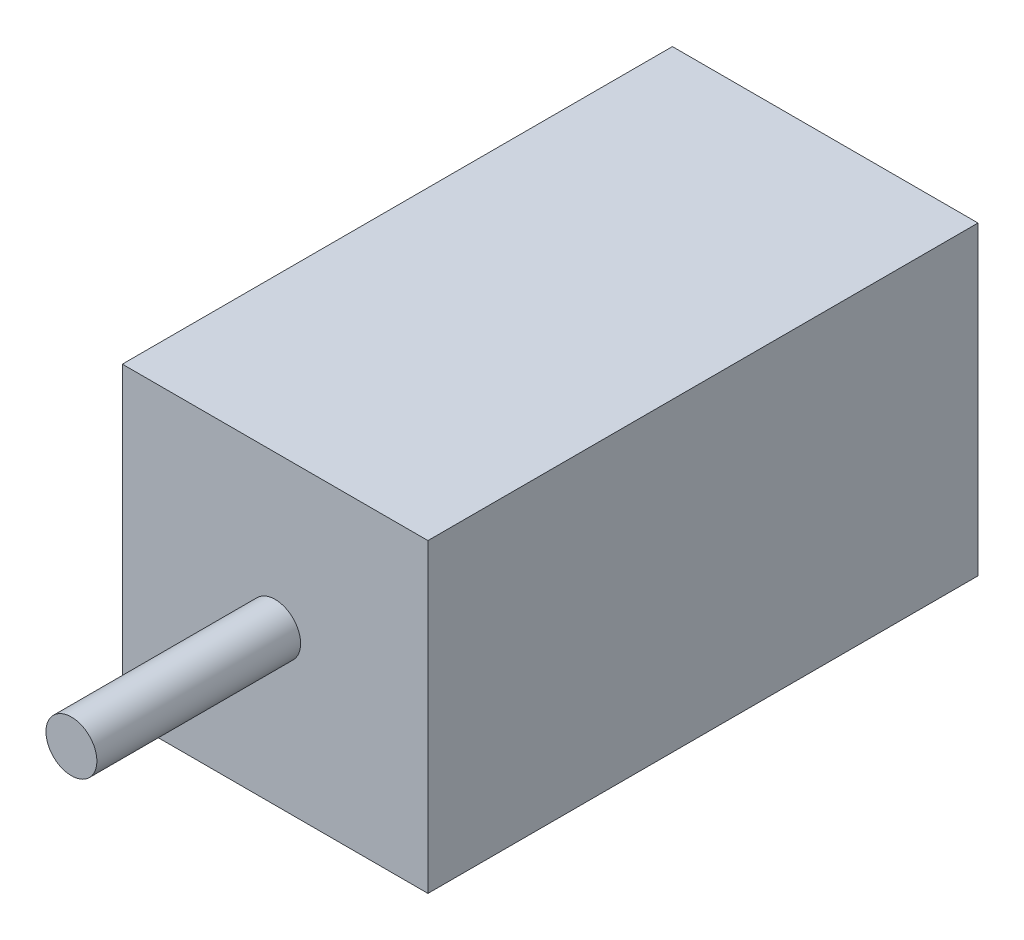
ISO-10303-21;
HEADER;
FILE_DESCRIPTION(('STEP AP214'),'2;1');
FILE_NAME('part.step','',(''),(''),'','','');
FILE_SCHEMA(('AUTOMOTIVE_DESIGN { 1 0 10303 214 1 1 1 1 }'));
ENDSEC;
DATA;
#1=APPLICATION_CONTEXT('core data for automotive mechanical design processes');
#2=APPLICATION_PROTOCOL_DEFINITION('international standard','automotive_design',2000,#1);
#3=PRODUCT_CONTEXT('',#1,'mechanical');
#4=PRODUCT('Part','Part','',(#3));
#5=PRODUCT_RELATED_PRODUCT_CATEGORY('part','',(#4));
#6=PRODUCT_DEFINITION_FORMATION('','',#4);
#7=PRODUCT_DEFINITION_CONTEXT('part definition',#1,'design');
#8=PRODUCT_DEFINITION('design','',#6,#7);
#9=PRODUCT_DEFINITION_SHAPE('','',#8);
#10=(LENGTH_UNIT() NAMED_UNIT(*) SI_UNIT(.MILLI.,.METRE.));
#11=(NAMED_UNIT(*) PLANE_ANGLE_UNIT() SI_UNIT($,.RADIAN.));
#12=(NAMED_UNIT(*) SI_UNIT($,.STERADIAN.) SOLID_ANGLE_UNIT());
#13=UNCERTAINTY_MEASURE_WITH_UNIT(LENGTH_MEASURE(1.E-05),#10,'distance_accuracy_value','');
#14=(GEOMETRIC_REPRESENTATION_CONTEXT(3) GLOBAL_UNCERTAINTY_ASSIGNED_CONTEXT((#13)) GLOBAL_UNIT_ASSIGNED_CONTEXT((#10,
#11,#12)) REPRESENTATION_CONTEXT('',''));
#15=CARTESIAN_POINT('',(0.,0.,0.));
#16=DIRECTION('',(0.,0.,1.));
#17=DIRECTION('',(1.,0.,0.));
#18=AXIS2_PLACEMENT_3D('',#15,#16,#17);
#19=CARTESIAN_POINT('',(0.,0.,27.));
#20=DIRECTION('',(1.,0.,0.));
#21=DIRECTION('',(0.,1.,0.));
#22=AXIS2_PLACEMENT_3D('',#19,#20,#21);
#23=PLANE('',#22);
#24=DIRECTION('',(0.,-1.,0.));
#25=VECTOR('',#24,1.);
#26=CARTESIAN_POINT('',(0.,0.,0.));
#27=LINE('',#26,#25);
#28=CARTESIAN_POINT('',(0.,0.,0.));
#29=VERTEX_POINT('',#28);
#30=CARTESIAN_POINT('',(0.,-15.,0.));
#31=VERTEX_POINT('',#30);
#32=EDGE_CURVE('E107',#29,#31,#27,.T.);
#33=ORIENTED_EDGE('',*,*,#32,.T.);
#34=DIRECTION('',(0.,0.,-1.));
#35=VECTOR('',#34,1.);
#36=CARTESIAN_POINT('',(0.,-15.,27.));
#37=LINE('',#36,#35);
#38=CARTESIAN_POINT('',(0.,-15.,27.));
#39=VERTEX_POINT('',#38);
#40=EDGE_CURVE('E11',#39,#31,#37,.T.);
#41=ORIENTED_EDGE('',*,*,#40,.F.);
#42=DIRECTION('',(0.,-1.,0.));
#43=VECTOR('',#42,1.);
#44=CARTESIAN_POINT('',(0.,0.,27.));
#45=LINE('',#44,#43);
#46=CARTESIAN_POINT('',(0.,0.,27.));
#47=VERTEX_POINT('',#46);
#48=EDGE_CURVE('E91',#47,#39,#45,.T.);
#49=ORIENTED_EDGE('',*,*,#48,.F.);
#50=DIRECTION('',(0.,0.,-1.));
#51=VECTOR('',#50,1.);
#52=CARTESIAN_POINT('',(0.,0.,27.));
#53=LINE('',#52,#51);
#54=EDGE_CURVE('E103',#47,#29,#53,.T.);
#55=ORIENTED_EDGE('',*,*,#54,.T.);
#56=EDGE_LOOP('',(#33,#41,#49,#55));
#57=FACE_BOUND('',#56,.T.);
#58=ADVANCED_FACE('F39',(#57),#23,.F.);
#59=CARTESIAN_POINT('',(0.,-15.,27.));
#60=DIRECTION('',(0.,1.,0.));
#61=DIRECTION('',(0.,0.,1.));
#62=AXIS2_PLACEMENT_3D('',#59,#60,#61);
#63=PLANE('',#62);
#64=DIRECTION('',(1.,0.,0.));
#65=VECTOR('',#64,1.);
#66=CARTESIAN_POINT('',(0.,-15.,0.));
#67=LINE('',#66,#65);
#68=CARTESIAN_POINT('',(15.,-15.,0.));
#69=VERTEX_POINT('',#68);
#70=EDGE_CURVE('E96',#31,#69,#67,.T.);
#71=ORIENTED_EDGE('',*,*,#70,.T.);
#72=DIRECTION('',(0.,0.,-1.));
#73=VECTOR('',#72,1.);
#74=CARTESIAN_POINT('',(15.,-15.,27.));
#75=LINE('',#74,#73);
#76=CARTESIAN_POINT('',(15.,-15.,27.));
#77=VERTEX_POINT('',#76);
#78=EDGE_CURVE('E48',#77,#69,#75,.T.);
#79=ORIENTED_EDGE('',*,*,#78,.F.);
#80=DIRECTION('',(1.,0.,0.));
#81=VECTOR('',#80,1.);
#82=CARTESIAN_POINT('',(0.,-15.,27.));
#83=LINE('',#82,#81);
#84=EDGE_CURVE('E86',#39,#77,#83,.T.);
#85=ORIENTED_EDGE('',*,*,#84,.F.);
#86=ORIENTED_EDGE('',*,*,#40,.T.);
#87=EDGE_LOOP('',(#71,#79,#85,#86));
#88=FACE_BOUND('',#87,.T.);
#89=ADVANCED_FACE('F95',(#88),#63,.F.);
#90=CARTESIAN_POINT('',(15.,0.,27.));
#91=DIRECTION('',(-1.,0.,0.));
#92=DIRECTION('',(0.,-1.,0.));
#93=AXIS2_PLACEMENT_3D('',#90,#91,#92);
#94=PLANE('',#93);
#95=DIRECTION('',(0.,1.,0.));
#96=VECTOR('',#95,1.);
#97=CARTESIAN_POINT('',(15.,0.,0.));
#98=LINE('',#97,#96);
#99=CARTESIAN_POINT('',(15.,0.,0.));
#100=VERTEX_POINT('',#99);
#101=EDGE_CURVE('E73',#69,#100,#98,.T.);
#102=ORIENTED_EDGE('',*,*,#101,.T.);
#103=DIRECTION('',(0.,0.,-1.));
#104=VECTOR('',#103,1.);
#105=CARTESIAN_POINT('',(15.,0.,27.));
#106=LINE('',#105,#104);
#107=CARTESIAN_POINT('',(15.,0.,27.));
#108=VERTEX_POINT('',#107);
#109=EDGE_CURVE('E98',#108,#100,#106,.T.);
#110=ORIENTED_EDGE('',*,*,#109,.F.);
#111=DIRECTION('',(0.,1.,0.));
#112=VECTOR('',#111,1.);
#113=CARTESIAN_POINT('',(15.,0.,27.));
#114=LINE('',#113,#112);
#115=EDGE_CURVE('E89',#77,#108,#114,.T.);
#116=ORIENTED_EDGE('',*,*,#115,.F.);
#117=ORIENTED_EDGE('',*,*,#78,.T.);
#118=EDGE_LOOP('',(#102,#110,#116,#117));
#119=FACE_BOUND('',#118,.T.);
#120=ADVANCED_FACE('F99',(#119),#94,.F.);
#121=CARTESIAN_POINT('',(0.,0.,27.));
#122=DIRECTION('',(0.,-1.,0.));
#123=DIRECTION('',(0.,0.,-1.));
#124=AXIS2_PLACEMENT_3D('',#121,#122,#123);
#125=PLANE('',#124);
#126=DIRECTION('',(-1.,0.,0.));
#127=VECTOR('',#126,1.);
#128=CARTESIAN_POINT('',(0.,0.,0.));
#129=LINE('',#128,#127);
#130=EDGE_CURVE('E79',#100,#29,#129,.T.);
#131=ORIENTED_EDGE('',*,*,#130,.T.);
#132=ORIENTED_EDGE('',*,*,#54,.F.);
#133=DIRECTION('',(-1.,0.,0.));
#134=VECTOR('',#133,1.);
#135=CARTESIAN_POINT('',(0.,0.,27.));
#136=LINE('',#135,#134);
#137=EDGE_CURVE('E56',#108,#47,#136,.T.);
#138=ORIENTED_EDGE('',*,*,#137,.F.);
#139=ORIENTED_EDGE('',*,*,#109,.T.);
#140=EDGE_LOOP('',(#131,#132,#138,#139));
#141=FACE_BOUND('',#140,.T.);
#142=ADVANCED_FACE('F121',(#141),#125,.F.);
#143=CARTESIAN_POINT('',(0.,0.,27.));
#144=DIRECTION('',(0.,0.,1.));
#145=DIRECTION('',(1.,0.,0.));
#146=AXIS2_PLACEMENT_3D('',#143,#144,#145);
#147=PLANE('',#146);
#148=CARTESIAN_POINT('',(7.5,-7.5,27.));
#149=DIRECTION('',(0.,0.,1.));
#150=DIRECTION('',(1.,0.,0.));
#151=AXIS2_PLACEMENT_3D('',#148,#149,#150);
#152=CIRCLE('',#151,1.25);
#153=CARTESIAN_POINT('',(8.75,-7.5,27.));
#154=VERTEX_POINT('',#153);
#155=EDGE_CURVE('E128',#154,#154,#152,.T.);
#156=ORIENTED_EDGE('',*,*,#155,.F.);
#157=EDGE_LOOP('',(#156));
#158=FACE_BOUND('',#157,.T.);
#159=ORIENTED_EDGE('',*,*,#48,.T.);
#160=ORIENTED_EDGE('',*,*,#84,.T.);
#161=ORIENTED_EDGE('',*,*,#115,.T.);
#162=ORIENTED_EDGE('',*,*,#137,.T.);
#163=EDGE_LOOP('',(#159,#160,#161,#162));
#164=FACE_BOUND('',#163,.T.);
#165=ADVANCED_FACE('F87',(#158,#164),#147,.T.);
#166=CARTESIAN_POINT('',(0.,0.,0.));
#167=DIRECTION('',(0.,0.,1.));
#168=DIRECTION('',(1.,0.,0.));
#169=AXIS2_PLACEMENT_3D('',#166,#167,#168);
#170=PLANE('',#169);
#171=ORIENTED_EDGE('',*,*,#32,.F.);
#172=ORIENTED_EDGE('',*,*,#130,.F.);
#173=ORIENTED_EDGE('',*,*,#101,.F.);
#174=ORIENTED_EDGE('',*,*,#70,.F.);
#175=EDGE_LOOP('',(#171,#172,#173,#174));
#176=FACE_BOUND('',#175,.T.);
#177=ADVANCED_FACE('F124',(#176),#170,.F.);
#178=CARTESIAN_POINT('',(7.5,-7.5,37.));
#179=DIRECTION('',(0.,0.,-1.));
#180=DIRECTION('',(-1.,0.,0.));
#181=AXIS2_PLACEMENT_3D('',#178,#179,#180);
#182=CYLINDRICAL_SURFACE('',#181,1.25);
#183=CARTESIAN_POINT('',(7.5,-7.5,37.));
#184=DIRECTION('',(0.,0.,1.));
#185=DIRECTION('',(1.,0.,0.));
#186=AXIS2_PLACEMENT_3D('',#183,#184,#185);
#187=CIRCLE('',#186,1.25);
#188=CARTESIAN_POINT('',(8.75,-7.5,37.));
#189=VERTEX_POINT('',#188);
#190=EDGE_CURVE('E111',#189,#189,#187,.T.);
#191=ORIENTED_EDGE('',*,*,#190,.F.);
#192=EDGE_LOOP('',(#191));
#193=FACE_BOUND('',#192,.T.);
#194=ORIENTED_EDGE('',*,*,#155,.T.);
#195=EDGE_LOOP('',(#194));
#196=FACE_BOUND('',#195,.T.);
#197=ADVANCED_FACE('F138',(#193,#196),#182,.T.);
#198=CARTESIAN_POINT('',(7.5,-7.5,37.));
#199=DIRECTION('',(0.,0.,1.));
#200=DIRECTION('',(1.,0.,0.));
#201=AXIS2_PLACEMENT_3D('',#198,#199,#200);
#202=PLANE('',#201);
#203=ORIENTED_EDGE('',*,*,#190,.T.);
#204=EDGE_LOOP('',(#203));
#205=FACE_BOUND('',#204,.T.);
#206=ADVANCED_FACE('F136',(#205),#202,.T.);
#207=CLOSED_SHELL('',(#58,#89,#120,#142,#165,#177,#197,#206));
#208=MANIFOLD_SOLID_BREP('B2',#207);
#209=ADVANCED_BREP_SHAPE_REPRESENTATION('',(#18,#208),#14);
#210=SHAPE_DEFINITION_REPRESENTATION(#9,#209);
ENDSEC;
END-ISO-10303-21;
